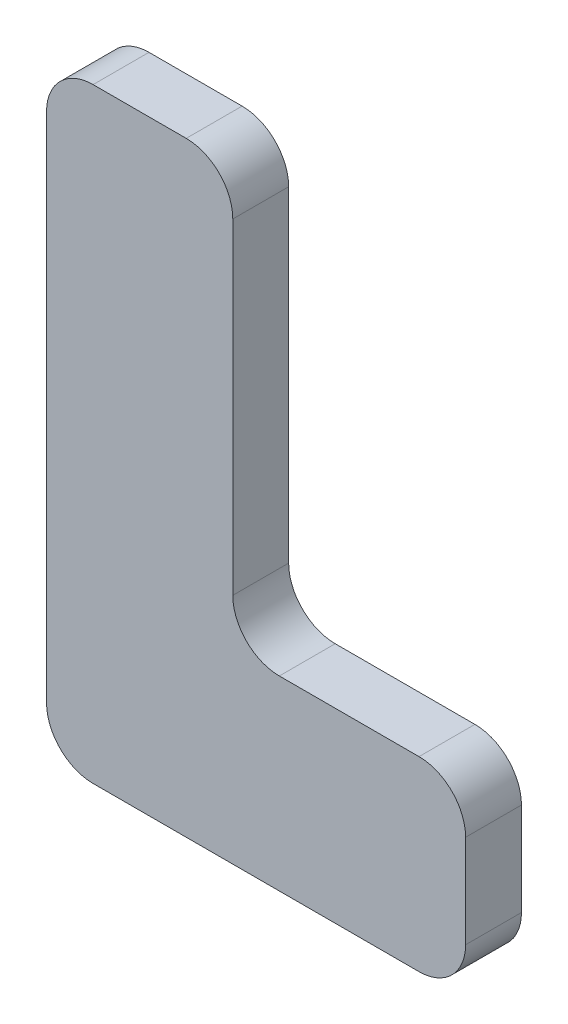
ISO-10303-21;
HEADER;
FILE_DESCRIPTION(('STEP AP214'),'2;1');
FILE_NAME('part.step','',(''),(''),'','','');
FILE_SCHEMA(('AUTOMOTIVE_DESIGN { 1 0 10303 214 1 1 1 1 }'));
ENDSEC;
DATA;
#1=APPLICATION_CONTEXT('core data for automotive mechanical design processes');
#2=APPLICATION_PROTOCOL_DEFINITION('international standard','automotive_design',2000,#1);
#3=PRODUCT_CONTEXT('',#1,'mechanical');
#4=PRODUCT('Part','Part','',(#3));
#5=PRODUCT_RELATED_PRODUCT_CATEGORY('part','',(#4));
#6=PRODUCT_DEFINITION_FORMATION('','',#4);
#7=PRODUCT_DEFINITION_CONTEXT('part definition',#1,'design');
#8=PRODUCT_DEFINITION('design','',#6,#7);
#9=PRODUCT_DEFINITION_SHAPE('','',#8);
#10=(LENGTH_UNIT() NAMED_UNIT(*) SI_UNIT(.MILLI.,.METRE.));
#11=(NAMED_UNIT(*) PLANE_ANGLE_UNIT() SI_UNIT($,.RADIAN.));
#12=(NAMED_UNIT(*) SI_UNIT($,.STERADIAN.) SOLID_ANGLE_UNIT());
#13=UNCERTAINTY_MEASURE_WITH_UNIT(LENGTH_MEASURE(1.E-05),#10,'distance_accuracy_value','');
#14=(GEOMETRIC_REPRESENTATION_CONTEXT(3) GLOBAL_UNCERTAINTY_ASSIGNED_CONTEXT((#13)) GLOBAL_UNIT_ASSIGNED_CONTEXT((#10,
#11,#12)) REPRESENTATION_CONTEXT('',''));
#15=CARTESIAN_POINT('',(0.,0.,0.));
#16=DIRECTION('',(0.,0.,1.));
#17=DIRECTION('',(1.,0.,0.));
#18=AXIS2_PLACEMENT_3D('',#15,#16,#17);
#19=CARTESIAN_POINT('',(-27.5308624222163,0.302172802420279,12.));
#20=DIRECTION('',(0.,0.,-1.));
#21=DIRECTION('',(-1.,0.,0.));
#22=AXIS2_PLACEMENT_3D('',#19,#20,#21);
#23=CYLINDRICAL_SURFACE('',#22,10.);
#24=CARTESIAN_POINT('',(-27.5308624222163,0.302172802420279,0.));
#25=DIRECTION('',(0.,0.,1.));
#26=DIRECTION('',(1.,0.,0.));
#27=AXIS2_PLACEMENT_3D('',#24,#25,#26);
#28=CIRCLE('',#27,10.);
#29=CARTESIAN_POINT('',(-27.5308624222163,-9.69782719757972,0.));
#30=VERTEX_POINT('',#29);
#31=CARTESIAN_POINT('',(-17.5308624222163,0.302172802420349,0.));
#32=VERTEX_POINT('',#31);
#33=EDGE_CURVE('E153',#30,#32,#28,.T.);
#34=ORIENTED_EDGE('',*,*,#33,.T.);
#35=DIRECTION('',(0.,0.,-1.));
#36=VECTOR('',#35,1.);
#37=CARTESIAN_POINT('',(-17.5308624222163,0.302172802420349,12.));
#38=LINE('',#37,#36);
#39=CARTESIAN_POINT('',(-17.5308624222163,0.302172802420349,12.));
#40=VERTEX_POINT('',#39);
#41=EDGE_CURVE('E11',#40,#32,#38,.T.);
#42=ORIENTED_EDGE('',*,*,#41,.F.);
#43=CARTESIAN_POINT('',(-27.5308624222163,0.302172802420279,12.));
#44=DIRECTION('',(0.,0.,1.));
#45=DIRECTION('',(1.,0.,0.));
#46=AXIS2_PLACEMENT_3D('',#43,#44,#45);
#47=CIRCLE('',#46,10.);
#48=CARTESIAN_POINT('',(-27.5308624222163,-9.69782719757972,12.));
#49=VERTEX_POINT('',#48);
#50=EDGE_CURVE('E175',#49,#40,#47,.T.);
#51=ORIENTED_EDGE('',*,*,#50,.F.);
#52=DIRECTION('',(0.,0.,-1.));
#53=VECTOR('',#52,1.);
#54=CARTESIAN_POINT('',(-27.5308624222163,-9.69782719757972,12.));
#55=LINE('',#54,#53);
#56=EDGE_CURVE('E149',#49,#30,#55,.T.);
#57=ORIENTED_EDGE('',*,*,#56,.T.);
#58=EDGE_LOOP('',(#34,#42,#51,#57));
#59=FACE_BOUND('',#58,.T.);
#60=ADVANCED_FACE('F33',(#59),#23,.T.);
#61=CARTESIAN_POINT('',(-17.5308624222163,0.302172802420349,12.));
#62=DIRECTION('',(-1.,0.,0.));
#63=DIRECTION('',(0.,-1.,0.));
#64=AXIS2_PLACEMENT_3D('',#61,#62,#63);
#65=PLANE('',#64);
#66=DIRECTION('',(0.,1.,0.));
#67=VECTOR('',#66,1.);
#68=CARTESIAN_POINT('',(-17.5308624222163,0.302172802420349,0.));
#69=LINE('',#68,#67);
#70=CARTESIAN_POINT('',(-17.5308624222162,20.3021728024203,0.));
#71=VERTEX_POINT('',#70);
#72=EDGE_CURVE('E156',#32,#71,#69,.T.);
#73=ORIENTED_EDGE('',*,*,#72,.T.);
#74=DIRECTION('',(0.,0.,-1.));
#75=VECTOR('',#74,1.);
#76=CARTESIAN_POINT('',(-17.5308624222162,20.3021728024203,12.));
#77=LINE('',#76,#75);
#78=CARTESIAN_POINT('',(-17.5308624222162,20.3021728024203,12.));
#79=VERTEX_POINT('',#78);
#80=EDGE_CURVE('E41',#79,#71,#77,.T.);
#81=ORIENTED_EDGE('',*,*,#80,.F.);
#82=DIRECTION('',(0.,1.,0.));
#83=VECTOR('',#82,1.);
#84=CARTESIAN_POINT('',(-17.5308624222163,0.302172802420349,12.));
#85=LINE('',#84,#83);
#86=EDGE_CURVE('E104',#40,#79,#85,.T.);
#87=ORIENTED_EDGE('',*,*,#86,.F.);
#88=ORIENTED_EDGE('',*,*,#41,.T.);
#89=EDGE_LOOP('',(#73,#81,#87,#88));
#90=FACE_BOUND('',#89,.T.);
#91=ADVANCED_FACE('F253',(#90),#65,.F.);
#92=CARTESIAN_POINT('',(-27.5308624222162,20.3021728024203,12.));
#93=DIRECTION('',(0.,0.,-1.));
#94=DIRECTION('',(-1.,0.,0.));
#95=AXIS2_PLACEMENT_3D('',#92,#93,#94);
#96=CYLINDRICAL_SURFACE('',#95,10.);
#97=CARTESIAN_POINT('',(-27.5308624222162,20.3021728024203,0.));
#98=DIRECTION('',(0.,0.,1.));
#99=DIRECTION('',(-1.,0.,0.));
#100=AXIS2_PLACEMENT_3D('',#97,#98,#99);
#101=CIRCLE('',#100,10.);
#102=CARTESIAN_POINT('',(-27.5308624222162,30.3021728024203,0.));
#103=VERTEX_POINT('',#102);
#104=EDGE_CURVE('E158',#71,#103,#101,.T.);
#105=ORIENTED_EDGE('',*,*,#104,.T.);
#106=DIRECTION('',(0.,0.,-1.));
#107=VECTOR('',#106,1.);
#108=CARTESIAN_POINT('',(-27.5308624222162,30.3021728024203,12.));
#109=LINE('',#108,#107);
#110=CARTESIAN_POINT('',(-27.5308624222162,30.3021728024203,12.));
#111=VERTEX_POINT('',#110);
#112=EDGE_CURVE('E194',#111,#103,#109,.T.);
#113=ORIENTED_EDGE('',*,*,#112,.F.);
#114=CARTESIAN_POINT('',(-27.5308624222162,20.3021728024203,12.));
#115=DIRECTION('',(0.,0.,1.));
#116=DIRECTION('',(-1.,0.,0.));
#117=AXIS2_PLACEMENT_3D('',#114,#115,#116);
#118=CIRCLE('',#117,10.);
#119=EDGE_CURVE('E202',#79,#111,#118,.T.);
#120=ORIENTED_EDGE('',*,*,#119,.F.);
#121=ORIENTED_EDGE('',*,*,#80,.T.);
#122=EDGE_LOOP('',(#105,#113,#120,#121));
#123=FACE_BOUND('',#122,.T.);
#124=ADVANCED_FACE('F200',(#123),#96,.T.);
#125=CARTESIAN_POINT('',(-57.5308624222162,30.3021728024203,12.));
#126=DIRECTION('',(0.,-1.,0.));
#127=DIRECTION('',(0.,0.,-1.));
#128=AXIS2_PLACEMENT_3D('',#125,#126,#127);
#129=PLANE('',#128);
#130=DIRECTION('',(-1.,0.,0.));
#131=VECTOR('',#130,1.);
#132=CARTESIAN_POINT('',(-57.5308624222162,30.3021728024203,0.));
#133=LINE('',#132,#131);
#134=CARTESIAN_POINT('',(-57.5308624222162,30.3021728024203,0.));
#135=VERTEX_POINT('',#134);
#136=EDGE_CURVE('E160',#103,#135,#133,.T.);
#137=ORIENTED_EDGE('',*,*,#136,.T.);
#138=DIRECTION('',(0.,0.,-1.));
#139=VECTOR('',#138,1.);
#140=CARTESIAN_POINT('',(-57.5308624222162,30.3021728024203,12.));
#141=LINE('',#140,#139);
#142=CARTESIAN_POINT('',(-57.5308624222162,30.3021728024203,12.));
#143=VERTEX_POINT('',#142);
#144=EDGE_CURVE('E191',#143,#135,#141,.T.);
#145=ORIENTED_EDGE('',*,*,#144,.F.);
#146=DIRECTION('',(-1.,0.,0.));
#147=VECTOR('',#146,1.);
#148=CARTESIAN_POINT('',(-57.5308624222162,30.3021728024203,12.));
#149=LINE('',#148,#147);
#150=EDGE_CURVE('E220',#111,#143,#149,.T.);
#151=ORIENTED_EDGE('',*,*,#150,.F.);
#152=ORIENTED_EDGE('',*,*,#112,.T.);
#153=EDGE_LOOP('',(#137,#145,#151,#152));
#154=FACE_BOUND('',#153,.T.);
#155=ADVANCED_FACE('F211',(#154),#129,.F.);
#156=CARTESIAN_POINT('',(-57.5308624222163,40.3021728024203,12.));
#157=DIRECTION('',(0.,0.,-1.));
#158=DIRECTION('',(-1.,0.,0.));
#159=AXIS2_PLACEMENT_3D('',#156,#157,#158);
#160=CYLINDRICAL_SURFACE('',#159,10.);
#161=CARTESIAN_POINT('',(-57.5308624222163,40.3021728024203,0.));
#162=DIRECTION('',(0.,0.,-1.));
#163=DIRECTION('',(-1.,0.,0.));
#164=AXIS2_PLACEMENT_3D('',#161,#162,#163);
#165=CIRCLE('',#164,10.);
#166=CARTESIAN_POINT('',(-67.5308624222162,40.3021728024204,0.));
#167=VERTEX_POINT('',#166);
#168=EDGE_CURVE('E162',#135,#167,#165,.T.);
#169=ORIENTED_EDGE('',*,*,#168,.T.);
#170=DIRECTION('',(0.,0.,-1.));
#171=VECTOR('',#170,1.);
#172=CARTESIAN_POINT('',(-67.5308624222162,40.3021728024204,12.));
#173=LINE('',#172,#171);
#174=CARTESIAN_POINT('',(-67.5308624222162,40.3021728024204,12.));
#175=VERTEX_POINT('',#174);
#176=EDGE_CURVE('E188',#175,#167,#173,.T.);
#177=ORIENTED_EDGE('',*,*,#176,.F.);
#178=CARTESIAN_POINT('',(-57.5308624222163,40.3021728024203,12.));
#179=DIRECTION('',(0.,0.,-1.));
#180=DIRECTION('',(-1.,0.,0.));
#181=AXIS2_PLACEMENT_3D('',#178,#179,#180);
#182=CIRCLE('',#181,10.);
#183=EDGE_CURVE('E217',#143,#175,#182,.T.);
#184=ORIENTED_EDGE('',*,*,#183,.F.);
#185=ORIENTED_EDGE('',*,*,#144,.T.);
#186=EDGE_LOOP('',(#169,#177,#184,#185));
#187=FACE_BOUND('',#186,.T.);
#188=ADVANCED_FACE('F215',(#187),#160,.F.);
#189=CARTESIAN_POINT('',(-67.5308624222163,110.30217280242,12.));
#190=DIRECTION('',(-1.,0.,0.));
#191=DIRECTION('',(0.,-1.,0.));
#192=AXIS2_PLACEMENT_3D('',#189,#190,#191);
#193=PLANE('',#192);
#194=DIRECTION('',(0.,1.,0.));
#195=VECTOR('',#194,1.);
#196=CARTESIAN_POINT('',(-67.5308624222163,110.30217280242,0.));
#197=LINE('',#196,#195);
#198=CARTESIAN_POINT('',(-67.5308624222163,110.30217280242,0.));
#199=VERTEX_POINT('',#198);
#200=EDGE_CURVE('E164',#167,#199,#197,.T.);
#201=ORIENTED_EDGE('',*,*,#200,.T.);
#202=DIRECTION('',(0.,0.,-1.));
#203=VECTOR('',#202,1.);
#204=CARTESIAN_POINT('',(-67.5308624222163,110.30217280242,12.));
#205=LINE('',#204,#203);
#206=CARTESIAN_POINT('',(-67.5308624222163,110.30217280242,12.));
#207=VERTEX_POINT('',#206);
#208=EDGE_CURVE('E185',#207,#199,#205,.T.);
#209=ORIENTED_EDGE('',*,*,#208,.F.);
#210=DIRECTION('',(0.,1.,0.));
#211=VECTOR('',#210,1.);
#212=CARTESIAN_POINT('',(-67.5308624222163,110.30217280242,12.));
#213=LINE('',#212,#211);
#214=EDGE_CURVE('E219',#175,#207,#213,.T.);
#215=ORIENTED_EDGE('',*,*,#214,.F.);
#216=ORIENTED_EDGE('',*,*,#176,.T.);
#217=EDGE_LOOP('',(#201,#209,#215,#216));
#218=FACE_BOUND('',#217,.T.);
#219=ADVANCED_FACE('F266',(#218),#193,.F.);
#220=CARTESIAN_POINT('',(-77.5308624222163,110.30217280242,12.));
#221=DIRECTION('',(0.,0.,-1.));
#222=DIRECTION('',(-1.,0.,0.));
#223=AXIS2_PLACEMENT_3D('',#220,#221,#222);
#224=CYLINDRICAL_SURFACE('',#223,9.99999999999999);
#225=CARTESIAN_POINT('',(-77.5308624222163,110.30217280242,0.));
#226=DIRECTION('',(0.,0.,1.));
#227=DIRECTION('',(-1.,0.,0.));
#228=AXIS2_PLACEMENT_3D('',#225,#226,#227);
#229=CIRCLE('',#228,9.99999999999999);
#230=CARTESIAN_POINT('',(-77.5308624222163,120.30217280242,0.));
#231=VERTEX_POINT('',#230);
#232=EDGE_CURVE('E166',#199,#231,#229,.T.);
#233=ORIENTED_EDGE('',*,*,#232,.T.);
#234=DIRECTION('',(0.,0.,-1.));
#235=VECTOR('',#234,1.);
#236=CARTESIAN_POINT('',(-77.5308624222163,120.30217280242,12.));
#237=LINE('',#236,#235);
#238=CARTESIAN_POINT('',(-77.5308624222163,120.30217280242,12.));
#239=VERTEX_POINT('',#238);
#240=EDGE_CURVE('E182',#239,#231,#237,.T.);
#241=ORIENTED_EDGE('',*,*,#240,.F.);
#242=CARTESIAN_POINT('',(-77.5308624222163,110.30217280242,12.));
#243=DIRECTION('',(0.,0.,1.));
#244=DIRECTION('',(-1.,0.,0.));
#245=AXIS2_PLACEMENT_3D('',#242,#243,#244);
#246=CIRCLE('',#245,9.99999999999999);
#247=EDGE_CURVE('E222',#207,#239,#246,.T.);
#248=ORIENTED_EDGE('',*,*,#247,.F.);
#249=ORIENTED_EDGE('',*,*,#208,.T.);
#250=EDGE_LOOP('',(#233,#241,#248,#249));
#251=FACE_BOUND('',#250,.T.);
#252=ADVANCED_FACE('F269',(#251),#224,.T.);
#253=CARTESIAN_POINT('',(-97.5308624222162,120.30217280242,12.));
#254=DIRECTION('',(0.,-1.,0.));
#255=DIRECTION('',(0.,0.,-1.));
#256=AXIS2_PLACEMENT_3D('',#253,#254,#255);
#257=PLANE('',#256);
#258=DIRECTION('',(-1.,0.,0.));
#259=VECTOR('',#258,1.);
#260=CARTESIAN_POINT('',(-97.5308624222162,120.30217280242,0.));
#261=LINE('',#260,#259);
#262=CARTESIAN_POINT('',(-97.5308624222162,120.30217280242,0.));
#263=VERTEX_POINT('',#262);
#264=EDGE_CURVE('E168',#231,#263,#261,.T.);
#265=ORIENTED_EDGE('',*,*,#264,.T.);
#266=DIRECTION('',(0.,0.,-1.));
#267=VECTOR('',#266,1.);
#268=CARTESIAN_POINT('',(-97.5308624222162,120.30217280242,12.));
#269=LINE('',#268,#267);
#270=CARTESIAN_POINT('',(-97.5308624222162,120.30217280242,12.));
#271=VERTEX_POINT('',#270);
#272=EDGE_CURVE('E179',#271,#263,#269,.T.);
#273=ORIENTED_EDGE('',*,*,#272,.F.);
#274=DIRECTION('',(-1.,0.,0.));
#275=VECTOR('',#274,1.);
#276=CARTESIAN_POINT('',(-97.5308624222162,120.30217280242,12.));
#277=LINE('',#276,#275);
#278=EDGE_CURVE('E228',#239,#271,#277,.T.);
#279=ORIENTED_EDGE('',*,*,#278,.F.);
#280=ORIENTED_EDGE('',*,*,#240,.T.);
#281=EDGE_LOOP('',(#265,#273,#279,#280));
#282=FACE_BOUND('',#281,.T.);
#283=ADVANCED_FACE('F234',(#282),#257,.F.);
#284=CARTESIAN_POINT('',(-97.5308624222163,110.30217280242,12.));
#285=DIRECTION('',(0.,0.,-1.));
#286=DIRECTION('',(-1.,0.,0.));
#287=AXIS2_PLACEMENT_3D('',#284,#285,#286);
#288=CYLINDRICAL_SURFACE('',#287,9.99999999999999);
#289=CARTESIAN_POINT('',(-97.5308624222163,110.30217280242,0.));
#290=DIRECTION('',(0.,0.,1.));
#291=DIRECTION('',(1.,0.,0.));
#292=AXIS2_PLACEMENT_3D('',#289,#290,#291);
#293=CIRCLE('',#292,9.99999999999999);
#294=CARTESIAN_POINT('',(-107.530862422216,110.30217280242,0.));
#295=VERTEX_POINT('',#294);
#296=EDGE_CURVE('E170',#263,#295,#293,.T.);
#297=ORIENTED_EDGE('',*,*,#296,.T.);
#298=DIRECTION('',(0.,0.,-1.));
#299=VECTOR('',#298,1.);
#300=CARTESIAN_POINT('',(-107.530862422216,110.30217280242,12.));
#301=LINE('',#300,#299);
#302=CARTESIAN_POINT('',(-107.530862422216,110.30217280242,12.));
#303=VERTEX_POINT('',#302);
#304=EDGE_CURVE('E144',#303,#295,#301,.T.);
#305=ORIENTED_EDGE('',*,*,#304,.F.);
#306=CARTESIAN_POINT('',(-97.5308624222163,110.30217280242,12.));
#307=DIRECTION('',(0.,0.,1.));
#308=DIRECTION('',(1.,0.,0.));
#309=AXIS2_PLACEMENT_3D('',#306,#307,#308);
#310=CIRCLE('',#309,9.99999999999999);
#311=EDGE_CURVE('E135',#271,#303,#310,.T.);
#312=ORIENTED_EDGE('',*,*,#311,.F.);
#313=ORIENTED_EDGE('',*,*,#272,.T.);
#314=EDGE_LOOP('',(#297,#305,#312,#313));
#315=FACE_BOUND('',#314,.T.);
#316=ADVANCED_FACE('F238',(#315),#288,.T.);
#317=CARTESIAN_POINT('',(-107.530862422216,110.30217280242,12.));
#318=DIRECTION('',(1.,0.,0.));
#319=DIRECTION('',(0.,0.,-1.));
#320=AXIS2_PLACEMENT_3D('',#317,#318,#319);
#321=PLANE('',#320);
#322=DIRECTION('',(0.,-1.,0.));
#323=VECTOR('',#322,1.);
#324=CARTESIAN_POINT('',(-107.530862422216,110.30217280242,0.));
#325=LINE('',#324,#323);
#326=CARTESIAN_POINT('',(-107.530862422216,0.30217280242035,0.));
#327=VERTEX_POINT('',#326);
#328=EDGE_CURVE('E143',#295,#327,#325,.T.);
#329=ORIENTED_EDGE('',*,*,#328,.T.);
#330=DIRECTION('',(0.,0.,-1.));
#331=VECTOR('',#330,1.);
#332=CARTESIAN_POINT('',(-107.530862422216,0.30217280242035,12.));
#333=LINE('',#332,#331);
#334=CARTESIAN_POINT('',(-107.530862422216,0.30217280242035,12.));
#335=VERTEX_POINT('',#334);
#336=EDGE_CURVE('E140',#335,#327,#333,.T.);
#337=ORIENTED_EDGE('',*,*,#336,.F.);
#338=DIRECTION('',(0.,-1.,0.));
#339=VECTOR('',#338,1.);
#340=CARTESIAN_POINT('',(-107.530862422216,110.30217280242,12.));
#341=LINE('',#340,#339);
#342=EDGE_CURVE('E129',#303,#335,#341,.T.);
#343=ORIENTED_EDGE('',*,*,#342,.F.);
#344=ORIENTED_EDGE('',*,*,#304,.T.);
#345=EDGE_LOOP('',(#329,#337,#343,#344));
#346=FACE_BOUND('',#345,.T.);
#347=ADVANCED_FACE('F141',(#346),#321,.F.);
#348=CARTESIAN_POINT('',(-97.5308624222163,0.302172802420278,12.));
#349=DIRECTION('',(0.,0.,-1.));
#350=DIRECTION('',(-1.,0.,0.));
#351=AXIS2_PLACEMENT_3D('',#348,#349,#350);
#352=CYLINDRICAL_SURFACE('',#351,10.);
#353=CARTESIAN_POINT('',(-97.5308624222163,0.302172802420278,0.));
#354=DIRECTION('',(0.,0.,1.));
#355=DIRECTION('',(1.,0.,0.));
#356=AXIS2_PLACEMENT_3D('',#353,#354,#355);
#357=CIRCLE('',#356,10.);
#358=CARTESIAN_POINT('',(-97.5308624222162,-9.69782719757972,0.));
#359=VERTEX_POINT('',#358);
#360=EDGE_CURVE('E90',#327,#359,#357,.T.);
#361=ORIENTED_EDGE('',*,*,#360,.T.);
#362=DIRECTION('',(0.,0.,-1.));
#363=VECTOR('',#362,1.);
#364=CARTESIAN_POINT('',(-97.5308624222162,-9.69782719757972,12.));
#365=LINE('',#364,#363);
#366=CARTESIAN_POINT('',(-97.5308624222162,-9.69782719757972,12.));
#367=VERTEX_POINT('',#366);
#368=EDGE_CURVE('E145',#367,#359,#365,.T.);
#369=ORIENTED_EDGE('',*,*,#368,.F.);
#370=CARTESIAN_POINT('',(-97.5308624222163,0.302172802420278,12.));
#371=DIRECTION('',(0.,0.,1.));
#372=DIRECTION('',(1.,0.,0.));
#373=AXIS2_PLACEMENT_3D('',#370,#371,#372);
#374=CIRCLE('',#373,10.);
#375=EDGE_CURVE('E133',#335,#367,#374,.T.);
#376=ORIENTED_EDGE('',*,*,#375,.F.);
#377=ORIENTED_EDGE('',*,*,#336,.T.);
#378=EDGE_LOOP('',(#361,#369,#376,#377));
#379=FACE_BOUND('',#378,.T.);
#380=ADVANCED_FACE('F147',(#379),#352,.T.);
#381=CARTESIAN_POINT('',(-97.5308624222162,-9.69782719757972,12.));
#382=DIRECTION('',(0.,1.,0.));
#383=DIRECTION('',(0.,0.,1.));
#384=AXIS2_PLACEMENT_3D('',#381,#382,#383);
#385=PLANE('',#384);
#386=DIRECTION('',(1.,0.,0.));
#387=VECTOR('',#386,1.);
#388=CARTESIAN_POINT('',(-97.5308624222162,-9.69782719757972,0.));
#389=LINE('',#388,#387);
#390=EDGE_CURVE('E96',#359,#30,#389,.T.);
#391=ORIENTED_EDGE('',*,*,#390,.T.);
#392=ORIENTED_EDGE('',*,*,#56,.F.);
#393=DIRECTION('',(1.,0.,0.));
#394=VECTOR('',#393,1.);
#395=CARTESIAN_POINT('',(-97.5308624222162,-9.69782719757972,12.));
#396=LINE('',#395,#394);
#397=EDGE_CURVE('E49',#367,#49,#396,.T.);
#398=ORIENTED_EDGE('',*,*,#397,.F.);
#399=ORIENTED_EDGE('',*,*,#368,.T.);
#400=EDGE_LOOP('',(#391,#392,#398,#399));
#401=FACE_BOUND('',#400,.T.);
#402=ADVANCED_FACE('F242',(#401),#385,.F.);
#403=CARTESIAN_POINT('',(-27.5308624222163,0.302172802420279,12.));
#404=DIRECTION('',(0.,0.,1.));
#405=DIRECTION('',(1.,0.,0.));
#406=AXIS2_PLACEMENT_3D('',#403,#404,#405);
#407=PLANE('',#406);
#408=ORIENTED_EDGE('',*,*,#50,.T.);
#409=ORIENTED_EDGE('',*,*,#86,.T.);
#410=ORIENTED_EDGE('',*,*,#119,.T.);
#411=ORIENTED_EDGE('',*,*,#150,.T.);
#412=ORIENTED_EDGE('',*,*,#183,.T.);
#413=ORIENTED_EDGE('',*,*,#214,.T.);
#414=ORIENTED_EDGE('',*,*,#247,.T.);
#415=ORIENTED_EDGE('',*,*,#278,.T.);
#416=ORIENTED_EDGE('',*,*,#311,.T.);
#417=ORIENTED_EDGE('',*,*,#342,.T.);
#418=ORIENTED_EDGE('',*,*,#375,.T.);
#419=ORIENTED_EDGE('',*,*,#397,.T.);
#420=EDGE_LOOP('',(#408,#409,#410,#411,#412,#413,#414,#415,#416,#417,#418,#419));
#421=FACE_BOUND('',#420,.T.);
#422=ADVANCED_FACE('F131',(#421),#407,.T.);
#423=CARTESIAN_POINT('',(-27.5308624222163,0.302172802420279,0.));
#424=DIRECTION('',(0.,0.,1.));
#425=DIRECTION('',(1.,0.,0.));
#426=AXIS2_PLACEMENT_3D('',#423,#424,#425);
#427=PLANE('',#426);
#428=ORIENTED_EDGE('',*,*,#33,.F.);
#429=ORIENTED_EDGE('',*,*,#390,.F.);
#430=ORIENTED_EDGE('',*,*,#360,.F.);
#431=ORIENTED_EDGE('',*,*,#328,.F.);
#432=ORIENTED_EDGE('',*,*,#296,.F.);
#433=ORIENTED_EDGE('',*,*,#264,.F.);
#434=ORIENTED_EDGE('',*,*,#232,.F.);
#435=ORIENTED_EDGE('',*,*,#200,.F.);
#436=ORIENTED_EDGE('',*,*,#168,.F.);
#437=ORIENTED_EDGE('',*,*,#136,.F.);
#438=ORIENTED_EDGE('',*,*,#104,.F.);
#439=ORIENTED_EDGE('',*,*,#72,.F.);
#440=EDGE_LOOP('',(#428,#429,#430,#431,#432,#433,#434,#435,#436,#437,#438,#439));
#441=FACE_BOUND('',#440,.T.);
#442=ADVANCED_FACE('F206',(#441),#427,.F.);
#443=CLOSED_SHELL('',(#60,#91,#124,#155,#188,#219,#252,#283,#316,#347,#380,#402,#422,#442));
#444=MANIFOLD_SOLID_BREP('B2',#443);
#445=ADVANCED_BREP_SHAPE_REPRESENTATION('',(#18,#444),#14);
#446=SHAPE_DEFINITION_REPRESENTATION(#9,#445);
ENDSEC;
END-ISO-10303-21;
